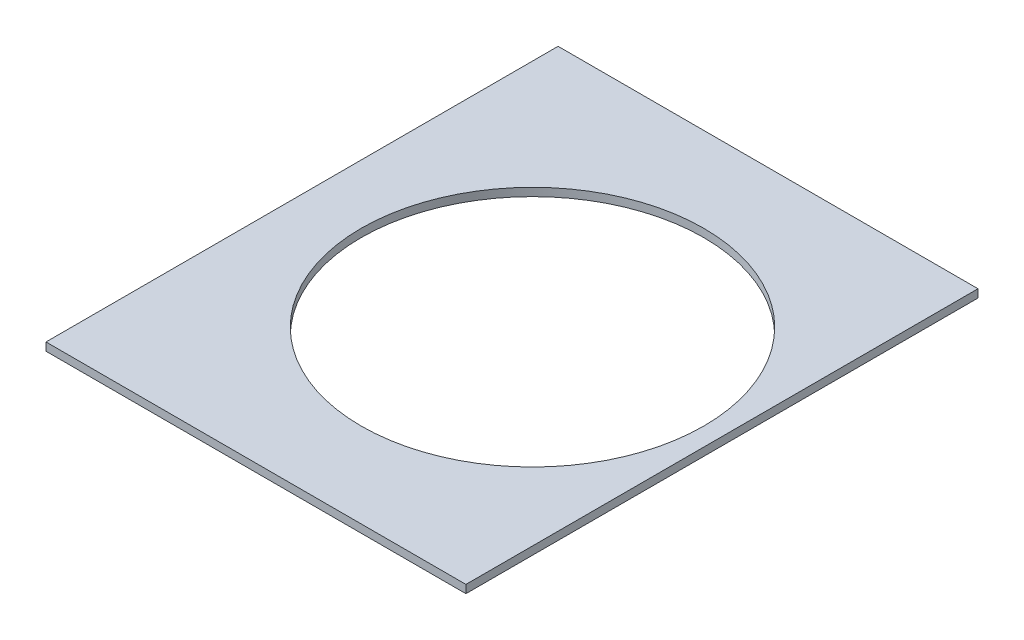
ISO-10303-21;
HEADER;
FILE_DESCRIPTION(('STEP AP214'),'2;1');
FILE_NAME('part.step','',(''),(''),'','','');
FILE_SCHEMA(('AUTOMOTIVE_DESIGN { 1 0 10303 214 1 1 1 1 }'));
ENDSEC;
DATA;
#1=APPLICATION_CONTEXT('core data for automotive mechanical design processes');
#2=APPLICATION_PROTOCOL_DEFINITION('international standard','automotive_design',2000,#1);
#3=PRODUCT_CONTEXT('',#1,'mechanical');
#4=PRODUCT('Part','Part','',(#3));
#5=PRODUCT_RELATED_PRODUCT_CATEGORY('part','',(#4));
#6=PRODUCT_DEFINITION_FORMATION('','',#4);
#7=PRODUCT_DEFINITION_CONTEXT('part definition',#1,'design');
#8=PRODUCT_DEFINITION('design','',#6,#7);
#9=PRODUCT_DEFINITION_SHAPE('','',#8);
#10=(LENGTH_UNIT() NAMED_UNIT(*) SI_UNIT(.MILLI.,.METRE.));
#11=(NAMED_UNIT(*) PLANE_ANGLE_UNIT() SI_UNIT($,.RADIAN.));
#12=(NAMED_UNIT(*) SI_UNIT($,.STERADIAN.) SOLID_ANGLE_UNIT());
#13=UNCERTAINTY_MEASURE_WITH_UNIT(LENGTH_MEASURE(1.E-05),#10,'distance_accuracy_value','');
#14=(GEOMETRIC_REPRESENTATION_CONTEXT(3) GLOBAL_UNCERTAINTY_ASSIGNED_CONTEXT((#13)) GLOBAL_UNIT_ASSIGNED_CONTEXT((#10,
#11,#12)) REPRESENTATION_CONTEXT('',''));
#15=CARTESIAN_POINT('',(0.,0.,0.));
#16=DIRECTION('',(0.,0.,1.));
#17=DIRECTION('',(1.,0.,0.));
#18=AXIS2_PLACEMENT_3D('',#15,#16,#17);
#19=CARTESIAN_POINT('',(52.07,1.00076,0.));
#20=DIRECTION('',(1.,0.,0.));
#21=DIRECTION('',(0.,0.,-1.));
#22=AXIS2_PLACEMENT_3D('',#19,#20,#21);
#23=PLANE('',#22);
#24=DIRECTION('',(0.,0.,1.));
#25=VECTOR('',#24,1.);
#26=CARTESIAN_POINT('',(52.07,0.,0.));
#27=LINE('',#26,#25);
#28=CARTESIAN_POINT('',(52.07,0.,-63.5));
#29=VERTEX_POINT('',#28);
#30=CARTESIAN_POINT('',(52.07,0.,0.));
#31=VERTEX_POINT('',#30);
#32=EDGE_CURVE('E118',#29,#31,#27,.T.);
#33=ORIENTED_EDGE('',*,*,#32,.F.);
#34=DIRECTION('',(0.,-1.,0.));
#35=VECTOR('',#34,1.);
#36=CARTESIAN_POINT('',(52.07,1.00076,-63.5));
#37=LINE('',#36,#35);
#38=CARTESIAN_POINT('',(52.07,1.00076,-63.5));
#39=VERTEX_POINT('',#38);
#40=EDGE_CURVE('E11',#39,#29,#37,.T.);
#41=ORIENTED_EDGE('',*,*,#40,.F.);
#42=DIRECTION('',(0.,0.,1.));
#43=VECTOR('',#42,1.);
#44=CARTESIAN_POINT('',(52.07,1.00076,0.));
#45=LINE('',#44,#43);
#46=CARTESIAN_POINT('',(52.07,1.00076,0.));
#47=VERTEX_POINT('',#46);
#48=EDGE_CURVE('E103',#39,#47,#45,.T.);
#49=ORIENTED_EDGE('',*,*,#48,.T.);
#50=DIRECTION('',(0.,-1.,0.));
#51=VECTOR('',#50,1.);
#52=CARTESIAN_POINT('',(52.07,1.00076,0.));
#53=LINE('',#52,#51);
#54=EDGE_CURVE('E63',#47,#31,#53,.T.);
#55=ORIENTED_EDGE('',*,*,#54,.T.);
#56=EDGE_LOOP('',(#33,#41,#49,#55));
#57=FACE_BOUND('',#56,.T.);
#58=ADVANCED_FACE('F45',(#57),#23,.T.);
#59=CARTESIAN_POINT('',(0.,1.00076,-63.5));
#60=DIRECTION('',(0.,0.,-1.));
#61=DIRECTION('',(-1.,0.,0.));
#62=AXIS2_PLACEMENT_3D('',#59,#60,#61);
#63=PLANE('',#62);
#64=DIRECTION('',(1.,0.,0.));
#65=VECTOR('',#64,1.);
#66=CARTESIAN_POINT('',(0.,0.,-63.5));
#67=LINE('',#66,#65);
#68=CARTESIAN_POINT('',(0.,0.,-63.5));
#69=VERTEX_POINT('',#68);
#70=EDGE_CURVE('E93',#69,#29,#67,.T.);
#71=ORIENTED_EDGE('',*,*,#70,.F.);
#72=DIRECTION('',(0.,-1.,0.));
#73=VECTOR('',#72,1.);
#74=CARTESIAN_POINT('',(0.,1.00076,-63.5));
#75=LINE('',#74,#73);
#76=CARTESIAN_POINT('',(0.,1.00076,-63.5));
#77=VERTEX_POINT('',#76);
#78=EDGE_CURVE('E55',#77,#69,#75,.T.);
#79=ORIENTED_EDGE('',*,*,#78,.F.);
#80=DIRECTION('',(1.,0.,0.));
#81=VECTOR('',#80,1.);
#82=CARTESIAN_POINT('',(0.,1.00076,-63.5));
#83=LINE('',#82,#81);
#84=EDGE_CURVE('E91',#77,#39,#83,.T.);
#85=ORIENTED_EDGE('',*,*,#84,.T.);
#86=ORIENTED_EDGE('',*,*,#40,.T.);
#87=EDGE_LOOP('',(#71,#79,#85,#86));
#88=FACE_BOUND('',#87,.T.);
#89=ADVANCED_FACE('F90',(#88),#63,.T.);
#90=CARTESIAN_POINT('',(0.,1.00076,0.));
#91=DIRECTION('',(-1.,0.,0.));
#92=DIRECTION('',(0.,0.,1.));
#93=AXIS2_PLACEMENT_3D('',#90,#91,#92);
#94=PLANE('',#93);
#95=DIRECTION('',(0.,0.,-1.));
#96=VECTOR('',#95,1.);
#97=CARTESIAN_POINT('',(0.,0.,0.));
#98=LINE('',#97,#96);
#99=CARTESIAN_POINT('',(0.,0.,0.));
#100=VERTEX_POINT('',#99);
#101=EDGE_CURVE('E123',#100,#69,#98,.T.);
#102=ORIENTED_EDGE('',*,*,#101,.F.);
#103=DIRECTION('',(0.,-1.,0.));
#104=VECTOR('',#103,1.);
#105=CARTESIAN_POINT('',(0.,1.00076,0.));
#106=LINE('',#105,#104);
#107=CARTESIAN_POINT('',(0.,1.00076,0.));
#108=VERTEX_POINT('',#107);
#109=EDGE_CURVE('E76',#108,#100,#106,.T.);
#110=ORIENTED_EDGE('',*,*,#109,.F.);
#111=DIRECTION('',(0.,0.,-1.));
#112=VECTOR('',#111,1.);
#113=CARTESIAN_POINT('',(0.,1.00076,0.));
#114=LINE('',#113,#112);
#115=EDGE_CURVE('E102',#108,#77,#114,.T.);
#116=ORIENTED_EDGE('',*,*,#115,.T.);
#117=ORIENTED_EDGE('',*,*,#78,.T.);
#118=EDGE_LOOP('',(#102,#110,#116,#117));
#119=FACE_BOUND('',#118,.T.);
#120=ADVANCED_FACE('F106',(#119),#94,.T.);
#121=CARTESIAN_POINT('',(28.575,1.00076,-31.75));
#122=DIRECTION('',(0.,-1.,0.));
#123=DIRECTION('',(0.,0.,-1.));
#124=AXIS2_PLACEMENT_3D('',#121,#122,#123);
#125=CYLINDRICAL_SURFACE('',#124,21.2401567555421);
#126=CARTESIAN_POINT('',(28.575,1.00076,-31.75));
#127=DIRECTION('',(0.,1.,0.));
#128=DIRECTION('',(0.,0.,1.));
#129=AXIS2_PLACEMENT_3D('',#126,#127,#128);
#130=CIRCLE('',#129,21.2401567555421);
#131=CARTESIAN_POINT('',(28.575,1.00076,-10.5098432444579));
#132=VERTEX_POINT('',#131);
#133=EDGE_CURVE('E130',#132,#132,#130,.T.);
#134=ORIENTED_EDGE('',*,*,#133,.T.);
#135=EDGE_LOOP('',(#134));
#136=FACE_BOUND('',#135,.T.);
#137=CARTESIAN_POINT('',(28.575,0.,-31.75));
#138=DIRECTION('',(0.,1.,0.));
#139=DIRECTION('',(0.,0.,1.));
#140=AXIS2_PLACEMENT_3D('',#137,#138,#139);
#141=CIRCLE('',#140,21.2401567555421);
#142=CARTESIAN_POINT('',(28.575,0.,-10.5098432444579));
#143=VERTEX_POINT('',#142);
#144=EDGE_CURVE('E114',#143,#143,#141,.T.);
#145=ORIENTED_EDGE('',*,*,#144,.F.);
#146=EDGE_LOOP('',(#145));
#147=FACE_BOUND('',#146,.T.);
#148=ADVANCED_FACE('F47',(#136,#147),#125,.F.);
#149=CARTESIAN_POINT('',(0.,1.00076,0.));
#150=DIRECTION('',(0.,0.,1.));
#151=DIRECTION('',(1.,0.,0.));
#152=AXIS2_PLACEMENT_3D('',#149,#150,#151);
#153=PLANE('',#152);
#154=DIRECTION('',(-1.,0.,0.));
#155=VECTOR('',#154,1.);
#156=CARTESIAN_POINT('',(0.,0.,0.));
#157=LINE('',#156,#155);
#158=EDGE_CURVE('E126',#31,#100,#157,.T.);
#159=ORIENTED_EDGE('',*,*,#158,.F.);
#160=ORIENTED_EDGE('',*,*,#54,.F.);
#161=DIRECTION('',(-1.,0.,0.));
#162=VECTOR('',#161,1.);
#163=CARTESIAN_POINT('',(0.,1.00076,0.));
#164=LINE('',#163,#162);
#165=EDGE_CURVE('E108',#47,#108,#164,.T.);
#166=ORIENTED_EDGE('',*,*,#165,.T.);
#167=ORIENTED_EDGE('',*,*,#109,.T.);
#168=EDGE_LOOP('',(#159,#160,#166,#167));
#169=FACE_BOUND('',#168,.T.);
#170=ADVANCED_FACE('F141',(#169),#153,.T.);
#171=CARTESIAN_POINT('',(0.,1.00076,0.));
#172=DIRECTION('',(0.,1.,0.));
#173=DIRECTION('',(0.,0.,1.));
#174=AXIS2_PLACEMENT_3D('',#171,#172,#173);
#175=PLANE('',#174);
#176=ORIENTED_EDGE('',*,*,#133,.F.);
#177=EDGE_LOOP('',(#176));
#178=FACE_BOUND('',#177,.T.);
#179=ORIENTED_EDGE('',*,*,#48,.F.);
#180=ORIENTED_EDGE('',*,*,#84,.F.);
#181=ORIENTED_EDGE('',*,*,#115,.F.);
#182=ORIENTED_EDGE('',*,*,#165,.F.);
#183=EDGE_LOOP('',(#179,#180,#181,#182));
#184=FACE_BOUND('',#183,.T.);
#185=ADVANCED_FACE('F100',(#178,#184),#175,.T.);
#186=CARTESIAN_POINT('',(0.,0.,0.));
#187=DIRECTION('',(0.,1.,0.));
#188=DIRECTION('',(0.,0.,1.));
#189=AXIS2_PLACEMENT_3D('',#186,#187,#188);
#190=PLANE('',#189);
#191=ORIENTED_EDGE('',*,*,#144,.T.);
#192=EDGE_LOOP('',(#191));
#193=FACE_BOUND('',#192,.T.);
#194=ORIENTED_EDGE('',*,*,#32,.T.);
#195=ORIENTED_EDGE('',*,*,#158,.T.);
#196=ORIENTED_EDGE('',*,*,#101,.T.);
#197=ORIENTED_EDGE('',*,*,#70,.T.);
#198=EDGE_LOOP('',(#194,#195,#196,#197));
#199=FACE_BOUND('',#198,.T.);
#200=ADVANCED_FACE('F148',(#193,#199),#190,.F.);
#201=CLOSED_SHELL('',(#58,#89,#120,#148,#170,#185,#200));
#202=MANIFOLD_SOLID_BREP('B2',#201);
#203=ADVANCED_BREP_SHAPE_REPRESENTATION('',(#18,#202),#14);
#204=SHAPE_DEFINITION_REPRESENTATION(#9,#203);
ENDSEC;
END-ISO-10303-21;
